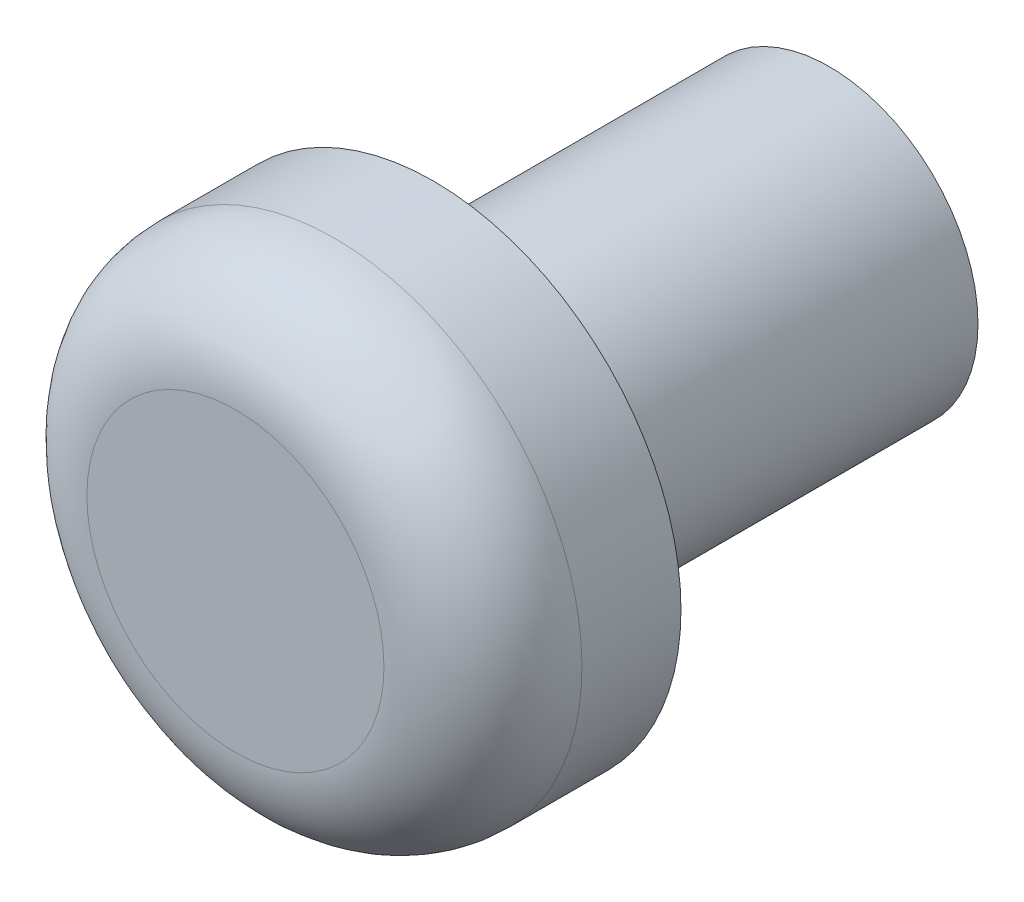
ISO-10303-21;
HEADER;
FILE_DESCRIPTION(('STEP AP214'),'2;1');
FILE_NAME('part.step','',(''),(''),'','','');
FILE_SCHEMA(('AUTOMOTIVE_DESIGN { 1 0 10303 214 1 1 1 1 }'));
ENDSEC;
DATA;
#1=APPLICATION_CONTEXT('core data for automotive mechanical design processes');
#2=APPLICATION_PROTOCOL_DEFINITION('international standard','automotive_design',2000,#1);
#3=PRODUCT_CONTEXT('',#1,'mechanical');
#4=PRODUCT('Part','Part','',(#3));
#5=PRODUCT_RELATED_PRODUCT_CATEGORY('part','',(#4));
#6=PRODUCT_DEFINITION_FORMATION('','',#4);
#7=PRODUCT_DEFINITION_CONTEXT('part definition',#1,'design');
#8=PRODUCT_DEFINITION('design','',#6,#7);
#9=PRODUCT_DEFINITION_SHAPE('','',#8);
#10=(LENGTH_UNIT() NAMED_UNIT(*) SI_UNIT(.MILLI.,.METRE.));
#11=(NAMED_UNIT(*) PLANE_ANGLE_UNIT() SI_UNIT($,.RADIAN.));
#12=(NAMED_UNIT(*) SI_UNIT($,.STERADIAN.) SOLID_ANGLE_UNIT());
#13=UNCERTAINTY_MEASURE_WITH_UNIT(LENGTH_MEASURE(1.E-05),#10,'distance_accuracy_value','');
#14=(GEOMETRIC_REPRESENTATION_CONTEXT(3) GLOBAL_UNCERTAINTY_ASSIGNED_CONTEXT((#13)) GLOBAL_UNIT_ASSIGNED_CONTEXT((#10,
#11,#12)) REPRESENTATION_CONTEXT('',''));
#15=CARTESIAN_POINT('',(0.,0.,0.));
#16=DIRECTION('',(0.,0.,1.));
#17=DIRECTION('',(1.,0.,0.));
#18=AXIS2_PLACEMENT_3D('',#15,#16,#17);
#19=CARTESIAN_POINT('',(0.,0.,-2.));
#20=DIRECTION('',(0.,0.,1.));
#21=DIRECTION('',(1.,0.,0.));
#22=AXIS2_PLACEMENT_3D('',#19,#20,#21);
#23=CYLINDRICAL_SURFACE('',#22,2.5);
#24=CARTESIAN_POINT('',(0.,0.,-1.));
#25=DIRECTION('',(0.,0.,1.));
#26=DIRECTION('',(1.,0.,0.));
#27=AXIS2_PLACEMENT_3D('',#24,#25,#26);
#28=CIRCLE('',#27,2.5);
#29=CARTESIAN_POINT('',(2.5,0.,-1.));
#30=VERTEX_POINT('',#29);
#31=EDGE_CURVE('E10',#30,#30,#28,.F.);
#32=ORIENTED_EDGE('',*,*,#31,.T.);
#33=EDGE_LOOP('',(#32));
#34=FACE_BOUND('',#33,.T.);
#35=CARTESIAN_POINT('',(0.,0.,-2.));
#36=DIRECTION('',(0.,0.,1.));
#37=DIRECTION('',(1.,0.,0.));
#38=AXIS2_PLACEMENT_3D('',#35,#36,#37);
#39=CIRCLE('',#38,2.5);
#40=CARTESIAN_POINT('',(2.5,0.,-2.));
#41=VERTEX_POINT('',#40);
#42=EDGE_CURVE('E50',#41,#41,#39,.T.);
#43=ORIENTED_EDGE('',*,*,#42,.T.);
#44=EDGE_LOOP('',(#43));
#45=FACE_BOUND('',#44,.T.);
#46=ADVANCED_FACE('F35',(#34,#45),#23,.T.);
#47=CARTESIAN_POINT('',(0.,0.,-2.));
#48=DIRECTION('',(0.,0.,1.));
#49=DIRECTION('',(1.,0.,0.));
#50=AXIS2_PLACEMENT_3D('',#47,#48,#49);
#51=PLANE('',#50);
#52=CARTESIAN_POINT('',(0.,0.,-2.));
#53=DIRECTION('',(0.,0.,-1.));
#54=DIRECTION('',(-1.,0.,0.));
#55=AXIS2_PLACEMENT_3D('',#52,#53,#54);
#56=CIRCLE('',#55,1.5);
#57=CARTESIAN_POINT('',(-1.5,0.,-2.));
#58=VERTEX_POINT('',#57);
#59=EDGE_CURVE('E46',#58,#58,#56,.T.);
#60=ORIENTED_EDGE('',*,*,#59,.F.);
#61=EDGE_LOOP('',(#60));
#62=FACE_BOUND('',#61,.T.);
#63=ORIENTED_EDGE('',*,*,#42,.F.);
#64=EDGE_LOOP('',(#63));
#65=FACE_BOUND('',#64,.T.);
#66=ADVANCED_FACE('F86',(#62,#65),#51,.F.);
#67=CARTESIAN_POINT('',(0.,0.,0.));
#68=DIRECTION('',(0.,0.,1.));
#69=DIRECTION('',(1.,0.,0.));
#70=AXIS2_PLACEMENT_3D('',#67,#68,#69);
#71=PLANE('',#70);
#72=CARTESIAN_POINT('',(0.,0.,0.));
#73=DIRECTION('',(0.,0.,1.));
#74=DIRECTION('',(1.,0.,0.));
#75=AXIS2_PLACEMENT_3D('',#72,#73,#74);
#76=CIRCLE('',#75,1.5);
#77=CARTESIAN_POINT('',(1.5,0.,0.));
#78=VERTEX_POINT('',#77);
#79=EDGE_CURVE('E42',#78,#78,#76,.T.);
#80=ORIENTED_EDGE('',*,*,#79,.T.);
#81=EDGE_LOOP('',(#80));
#82=FACE_BOUND('',#81,.T.);
#83=ADVANCED_FACE('F82',(#82),#71,.T.);
#84=CARTESIAN_POINT('',(0.,0.,-6.));
#85=DIRECTION('',(0.,0.,1.));
#86=DIRECTION('',(1.,0.,0.));
#87=AXIS2_PLACEMENT_3D('',#84,#85,#86);
#88=CYLINDRICAL_SURFACE('',#87,1.5);
#89=CARTESIAN_POINT('',(0.,0.,-6.));
#90=DIRECTION('',(0.,0.,-1.));
#91=DIRECTION('',(-1.,0.,0.));
#92=AXIS2_PLACEMENT_3D('',#89,#90,#91);
#93=CIRCLE('',#92,1.5);
#94=CARTESIAN_POINT('',(-1.5,0.,-6.));
#95=VERTEX_POINT('',#94);
#96=EDGE_CURVE('E54',#95,#95,#93,.T.);
#97=ORIENTED_EDGE('',*,*,#96,.F.);
#98=EDGE_LOOP('',(#97));
#99=FACE_BOUND('',#98,.T.);
#100=ORIENTED_EDGE('',*,*,#59,.T.);
#101=EDGE_LOOP('',(#100));
#102=FACE_BOUND('',#101,.T.);
#103=ADVANCED_FACE('F76',(#99,#102),#88,.T.);
#104=CARTESIAN_POINT('',(0.,0.,-6.));
#105=DIRECTION('',(0.,0.,-1.));
#106=DIRECTION('',(-1.,0.,0.));
#107=AXIS2_PLACEMENT_3D('',#104,#105,#106);
#108=PLANE('',#107);
#109=CARTESIAN_POINT('',(0.,0.,-6.));
#110=DIRECTION('',(0.,0.,-1.));
#111=DIRECTION('',(-1.,0.,0.));
#112=AXIS2_PLACEMENT_3D('',#109,#110,#111);
#113=CIRCLE('',#112,0.5);
#114=CARTESIAN_POINT('',(-0.5,0.,-6.));
#115=VERTEX_POINT('',#114);
#116=EDGE_CURVE('E59',#115,#115,#113,.T.);
#117=ORIENTED_EDGE('',*,*,#116,.F.);
#118=EDGE_LOOP('',(#117));
#119=FACE_BOUND('',#118,.T.);
#120=ORIENTED_EDGE('',*,*,#96,.T.);
#121=EDGE_LOOP('',(#120));
#122=FACE_BOUND('',#121,.T.);
#123=ADVANCED_FACE('F73',(#119,#122),#108,.T.);
#124=CARTESIAN_POINT('',(0.,0.,-1.));
#125=DIRECTION('',(0.,0.,1.));
#126=DIRECTION('',(1.,0.,0.));
#127=AXIS2_PLACEMENT_3D('',#124,#125,#126);
#128=TOROIDAL_SURFACE('',#127,1.5,1.);
#129=ORIENTED_EDGE('',*,*,#31,.F.);
#130=EDGE_LOOP('',(#129));
#131=FACE_BOUND('',#130,.T.);
#132=ORIENTED_EDGE('',*,*,#79,.F.);
#133=EDGE_LOOP('',(#132));
#134=FACE_BOUND('',#133,.T.);
#135=ADVANCED_FACE('F37',(#131,#134),#128,.T.);
#136=CARTESIAN_POINT('',(0.,0.,-4.));
#137=DIRECTION('',(0.,0.,-1.));
#138=DIRECTION('',(-1.,0.,0.));
#139=AXIS2_PLACEMENT_3D('',#136,#137,#138);
#140=CYLINDRICAL_SURFACE('',#139,0.5);
#141=CARTESIAN_POINT('',(0.,0.,-4.));
#142=DIRECTION('',(0.,0.,-1.));
#143=DIRECTION('',(-1.,0.,0.));
#144=AXIS2_PLACEMENT_3D('',#141,#142,#143);
#145=CIRCLE('',#144,0.5);
#146=CARTESIAN_POINT('',(-0.5,0.,-4.));
#147=VERTEX_POINT('',#146);
#148=EDGE_CURVE('E58',#147,#147,#145,.T.);
#149=ORIENTED_EDGE('',*,*,#148,.F.);
#150=EDGE_LOOP('',(#149));
#151=FACE_BOUND('',#150,.T.);
#152=ORIENTED_EDGE('',*,*,#116,.T.);
#153=EDGE_LOOP('',(#152));
#154=FACE_BOUND('',#153,.T.);
#155=ADVANCED_FACE('F67',(#151,#154),#140,.F.);
#156=CARTESIAN_POINT('',(0.,0.,-4.));
#157=DIRECTION('',(0.,0.,-1.));
#158=DIRECTION('',(-1.,0.,0.));
#159=AXIS2_PLACEMENT_3D('',#156,#157,#158);
#160=PLANE('',#159);
#161=ORIENTED_EDGE('',*,*,#148,.T.);
#162=EDGE_LOOP('',(#161));
#163=FACE_BOUND('',#162,.T.);
#164=ADVANCED_FACE('F65',(#163),#160,.T.);
#165=CLOSED_SHELL('',(#46,#66,#83,#103,#123,#135,#155,#164));
#166=MANIFOLD_SOLID_BREP('B2',#165);
#167=ADVANCED_BREP_SHAPE_REPRESENTATION('',(#18,#166),#14);
#168=SHAPE_DEFINITION_REPRESENTATION(#9,#167);
ENDSEC;
END-ISO-10303-21;
